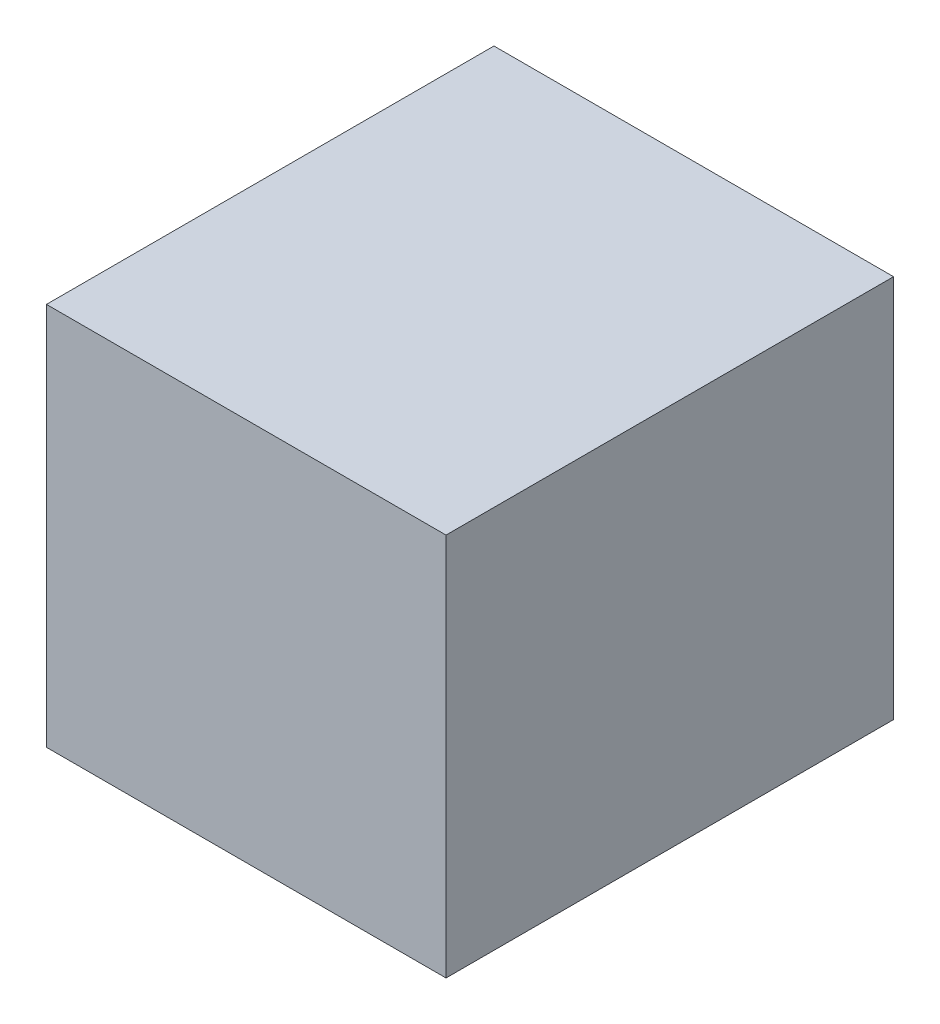
ISO-10303-21;
HEADER;
FILE_DESCRIPTION(('STEP AP214'),'2;1');
FILE_NAME('part.step','',(''),(''),'','','');
FILE_SCHEMA(('AUTOMOTIVE_DESIGN { 1 0 10303 214 1 1 1 1 }'));
ENDSEC;
DATA;
#1=APPLICATION_CONTEXT('core data for automotive mechanical design processes');
#2=APPLICATION_PROTOCOL_DEFINITION('international standard','automotive_design',2000,#1);
#3=PRODUCT_CONTEXT('',#1,'mechanical');
#4=PRODUCT('Part','Part','',(#3));
#5=PRODUCT_RELATED_PRODUCT_CATEGORY('part','',(#4));
#6=PRODUCT_DEFINITION_FORMATION('','',#4);
#7=PRODUCT_DEFINITION_CONTEXT('part definition',#1,'design');
#8=PRODUCT_DEFINITION('design','',#6,#7);
#9=PRODUCT_DEFINITION_SHAPE('','',#8);
#10=(LENGTH_UNIT() NAMED_UNIT(*) SI_UNIT(.MILLI.,.METRE.));
#11=(NAMED_UNIT(*) PLANE_ANGLE_UNIT() SI_UNIT($,.RADIAN.));
#12=(NAMED_UNIT(*) SI_UNIT($,.STERADIAN.) SOLID_ANGLE_UNIT());
#13=UNCERTAINTY_MEASURE_WITH_UNIT(LENGTH_MEASURE(1.E-05),#10,'distance_accuracy_value','');
#14=(GEOMETRIC_REPRESENTATION_CONTEXT(3) GLOBAL_UNCERTAINTY_ASSIGNED_CONTEXT((#13)) GLOBAL_UNIT_ASSIGNED_CONTEXT((#10,
#11,#12)) REPRESENTATION_CONTEXT('',''));
#15=CARTESIAN_POINT('',(0.,0.,0.));
#16=DIRECTION('',(0.,0.,1.));
#17=DIRECTION('',(1.,0.,0.));
#18=AXIS2_PLACEMENT_3D('',#15,#16,#17);
#19=CARTESIAN_POINT('',(0.62500002,0.5999988,0.));
#20=DIRECTION('',(0.,-1.,0.));
#21=DIRECTION('',(0.,0.,-1.));
#22=AXIS2_PLACEMENT_3D('',#19,#20,#21);
#23=PLANE('',#22);
#24=DIRECTION('',(0.,0.,-1.));
#25=VECTOR('',#24,1.);
#26=CARTESIAN_POINT('',(-0.62500002,0.5999988,0.));
#27=LINE('',#26,#25);
#28=CARTESIAN_POINT('',(-0.62500002,0.5999988,0.));
#29=VERTEX_POINT('',#28);
#30=CARTESIAN_POINT('',(-0.62500002,0.5999988,1.39999974));
#31=VERTEX_POINT('',#30);
#32=EDGE_CURVE('E20',#29,#31,#27,.F.);
#33=ORIENTED_EDGE('',*,*,#32,.T.);
#34=DIRECTION('',(-1.,0.,0.));
#35=VECTOR('',#34,1.);
#36=CARTESIAN_POINT('',(-0.62500002,0.5999988,1.39999974));
#37=LINE('',#36,#35);
#38=CARTESIAN_POINT('',(0.62500002,0.5999988,1.39999974));
#39=VERTEX_POINT('',#38);
#40=EDGE_CURVE('E55',#31,#39,#37,.F.);
#41=ORIENTED_EDGE('',*,*,#40,.T.);
#42=DIRECTION('',(0.,0.,1.));
#43=VECTOR('',#42,1.);
#44=CARTESIAN_POINT('',(0.62500002,0.5999988,0.));
#45=LINE('',#44,#43);
#46=CARTESIAN_POINT('',(0.62500002,0.5999988,0.));
#47=VERTEX_POINT('',#46);
#48=EDGE_CURVE('E74',#39,#47,#45,.F.);
#49=ORIENTED_EDGE('',*,*,#48,.T.);
#50=DIRECTION('',(-1.,0.,0.));
#51=VECTOR('',#50,1.);
#52=CARTESIAN_POINT('',(-0.62500002,0.5999988,0.));
#53=LINE('',#52,#51);
#54=EDGE_CURVE('E66',#29,#47,#53,.F.);
#55=ORIENTED_EDGE('',*,*,#54,.F.);
#56=EDGE_LOOP('',(#33,#41,#49,#55));
#57=FACE_BOUND('',#56,.T.);
#58=ADVANCED_FACE('F17',(#57),#23,.F.);
#59=CARTESIAN_POINT('',(-0.62500002,0.5999988,0.));
#60=DIRECTION('',(1.,0.,0.));
#61=DIRECTION('',(0.,0.,-1.));
#62=AXIS2_PLACEMENT_3D('',#59,#60,#61);
#63=PLANE('',#62);
#64=DIRECTION('',(0.,0.,1.));
#65=VECTOR('',#64,1.);
#66=CARTESIAN_POINT('',(-0.62500002,-0.5999988,0.));
#67=LINE('',#66,#65);
#68=CARTESIAN_POINT('',(-0.62500002,-0.5999988,0.));
#69=VERTEX_POINT('',#68);
#70=CARTESIAN_POINT('',(-0.62500002,-0.5999988,1.39999974));
#71=VERTEX_POINT('',#70);
#72=EDGE_CURVE('E72',#69,#71,#67,.T.);
#73=ORIENTED_EDGE('',*,*,#72,.T.);
#74=DIRECTION('',(0.,1.,0.));
#75=VECTOR('',#74,1.);
#76=CARTESIAN_POINT('',(-0.62500002,0.5999988,1.39999974));
#77=LINE('',#76,#75);
#78=EDGE_CURVE('E62',#71,#31,#77,.T.);
#79=ORIENTED_EDGE('',*,*,#78,.T.);
#80=ORIENTED_EDGE('',*,*,#32,.F.);
#81=DIRECTION('',(0.,1.,0.));
#82=VECTOR('',#81,1.);
#83=CARTESIAN_POINT('',(-0.62500002,0.5999988,0.));
#84=LINE('',#83,#82);
#85=EDGE_CURVE('E80',#69,#29,#84,.T.);
#86=ORIENTED_EDGE('',*,*,#85,.F.);
#87=EDGE_LOOP('',(#73,#79,#80,#86));
#88=FACE_BOUND('',#87,.T.);
#89=ADVANCED_FACE('F71',(#88),#63,.F.);
#90=CARTESIAN_POINT('',(-0.62500002,0.5999988,1.39999974));
#91=DIRECTION('',(0.,0.,-1.));
#92=DIRECTION('',(-1.,0.,0.));
#93=AXIS2_PLACEMENT_3D('',#90,#91,#92);
#94=PLANE('',#93);
#95=DIRECTION('',(1.,0.,0.));
#96=VECTOR('',#95,1.);
#97=CARTESIAN_POINT('',(-0.62500002,-0.5999988,1.39999974));
#98=LINE('',#97,#96);
#99=CARTESIAN_POINT('',(0.62500002,-0.5999988,1.39999974));
#100=VERTEX_POINT('',#99);
#101=EDGE_CURVE('E83',#71,#100,#98,.T.);
#102=ORIENTED_EDGE('',*,*,#101,.T.);
#103=DIRECTION('',(0.,1.,0.));
#104=VECTOR('',#103,1.);
#105=CARTESIAN_POINT('',(0.62500002,-0.5999988,1.39999974));
#106=LINE('',#105,#104);
#107=EDGE_CURVE('E64',#100,#39,#106,.T.);
#108=ORIENTED_EDGE('',*,*,#107,.T.);
#109=ORIENTED_EDGE('',*,*,#40,.F.);
#110=ORIENTED_EDGE('',*,*,#78,.F.);
#111=EDGE_LOOP('',(#102,#108,#109,#110));
#112=FACE_BOUND('',#111,.T.);
#113=ADVANCED_FACE('F60',(#112),#94,.F.);
#114=CARTESIAN_POINT('',(0.62500002,-0.5999988,0.));
#115=DIRECTION('',(-1.,0.,0.));
#116=DIRECTION('',(0.,0.,1.));
#117=AXIS2_PLACEMENT_3D('',#114,#115,#116);
#118=PLANE('',#117);
#119=ORIENTED_EDGE('',*,*,#48,.F.);
#120=ORIENTED_EDGE('',*,*,#107,.F.);
#121=DIRECTION('',(0.,0.,1.));
#122=VECTOR('',#121,1.);
#123=CARTESIAN_POINT('',(0.62500002,-0.5999988,0.));
#124=LINE('',#123,#122);
#125=CARTESIAN_POINT('',(0.62500002,-0.5999988,0.));
#126=VERTEX_POINT('',#125);
#127=EDGE_CURVE('E26',#100,#126,#124,.F.);
#128=ORIENTED_EDGE('',*,*,#127,.T.);
#129=DIRECTION('',(0.,1.,0.));
#130=VECTOR('',#129,1.);
#131=CARTESIAN_POINT('',(0.62500002,0.5999988,0.));
#132=LINE('',#131,#130);
#133=EDGE_CURVE('E34',#47,#126,#132,.F.);
#134=ORIENTED_EDGE('',*,*,#133,.F.);
#135=EDGE_LOOP('',(#119,#120,#128,#134));
#136=FACE_BOUND('',#135,.T.);
#137=ADVANCED_FACE('F88',(#136),#118,.F.);
#138=CARTESIAN_POINT('',(-0.62500002,0.5999988,0.));
#139=DIRECTION('',(0.,0.,-1.));
#140=DIRECTION('',(-1.,0.,0.));
#141=AXIS2_PLACEMENT_3D('',#138,#139,#140);
#142=PLANE('',#141);
#143=DIRECTION('',(1.,0.,0.));
#144=VECTOR('',#143,1.);
#145=CARTESIAN_POINT('',(-0.62500002,-0.5999988,0.));
#146=LINE('',#145,#144);
#147=EDGE_CURVE('E11',#126,#69,#146,.F.);
#148=ORIENTED_EDGE('',*,*,#147,.T.);
#149=ORIENTED_EDGE('',*,*,#85,.T.);
#150=ORIENTED_EDGE('',*,*,#54,.T.);
#151=ORIENTED_EDGE('',*,*,#133,.T.);
#152=EDGE_LOOP('',(#148,#149,#150,#151));
#153=FACE_BOUND('',#152,.T.);
#154=ADVANCED_FACE('F91',(#153),#142,.T.);
#155=CARTESIAN_POINT('',(-0.62500002,-0.5999988,0.));
#156=DIRECTION('',(0.,1.,0.));
#157=DIRECTION('',(0.,0.,1.));
#158=AXIS2_PLACEMENT_3D('',#155,#156,#157);
#159=PLANE('',#158);
#160=ORIENTED_EDGE('',*,*,#127,.F.);
#161=ORIENTED_EDGE('',*,*,#101,.F.);
#162=ORIENTED_EDGE('',*,*,#72,.F.);
#163=ORIENTED_EDGE('',*,*,#147,.F.);
#164=EDGE_LOOP('',(#160,#161,#162,#163));
#165=FACE_BOUND('',#164,.T.);
#166=ADVANCED_FACE('F90',(#165),#159,.F.);
#167=CLOSED_SHELL('',(#58,#89,#113,#137,#154,#166));
#168=MANIFOLD_SOLID_BREP('B1',#167);
#169=ADVANCED_BREP_SHAPE_REPRESENTATION('',(#18,#168),#14);
#170=SHAPE_DEFINITION_REPRESENTATION(#9,#169);
ENDSEC;
END-ISO-10303-21;
